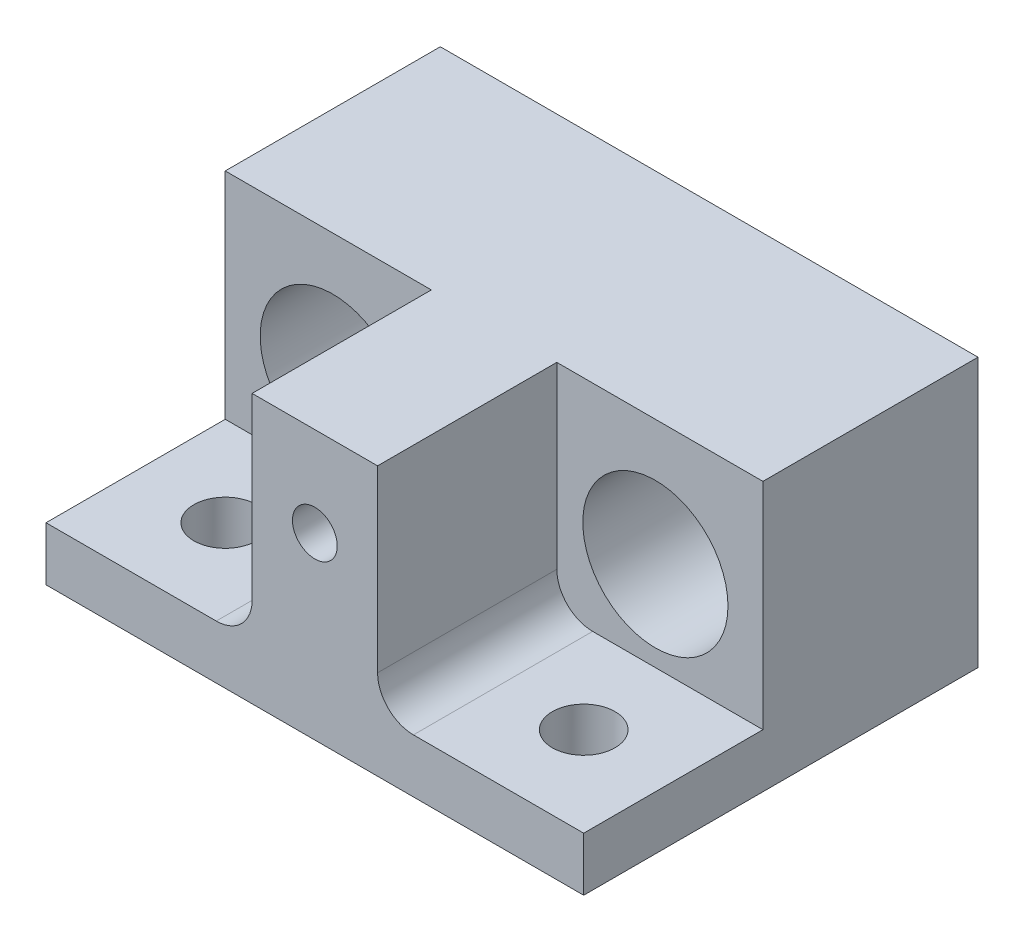
ISO-10303-21;
HEADER;
FILE_DESCRIPTION(('STEP AP214'),'2;1');
FILE_NAME('part.step','',(''),(''),'','','');
FILE_SCHEMA(('AUTOMOTIVE_DESIGN { 1 0 10303 214 1 1 1 1 }'));
ENDSEC;
DATA;
#1=APPLICATION_CONTEXT('core data for automotive mechanical design processes');
#2=APPLICATION_PROTOCOL_DEFINITION('international standard','automotive_design',2000,#1);
#3=PRODUCT_CONTEXT('',#1,'mechanical');
#4=PRODUCT('Part','Part','',(#3));
#5=PRODUCT_RELATED_PRODUCT_CATEGORY('part','',(#4));
#6=PRODUCT_DEFINITION_FORMATION('','',#4);
#7=PRODUCT_DEFINITION_CONTEXT('part definition',#1,'design');
#8=PRODUCT_DEFINITION('design','',#6,#7);
#9=PRODUCT_DEFINITION_SHAPE('','',#8);
#10=(LENGTH_UNIT() NAMED_UNIT(*) SI_UNIT(.MILLI.,.METRE.));
#11=(NAMED_UNIT(*) PLANE_ANGLE_UNIT() SI_UNIT($,.RADIAN.));
#12=(NAMED_UNIT(*) SI_UNIT($,.STERADIAN.) SOLID_ANGLE_UNIT());
#13=UNCERTAINTY_MEASURE_WITH_UNIT(LENGTH_MEASURE(1.E-05),#10,'distance_accuracy_value','');
#14=(GEOMETRIC_REPRESENTATION_CONTEXT(3) GLOBAL_UNCERTAINTY_ASSIGNED_CONTEXT((#13)) GLOBAL_UNIT_ASSIGNED_CONTEXT((#10,
#11,#12)) REPRESENTATION_CONTEXT('',''));
#15=CARTESIAN_POINT('',(0.,0.,0.));
#16=DIRECTION('',(0.,0.,1.));
#17=DIRECTION('',(1.,0.,0.));
#18=AXIS2_PLACEMENT_3D('',#15,#16,#17);
#19=CARTESIAN_POINT('',(15.,15.,11.));
#20=DIRECTION('',(-1.,0.,0.));
#21=DIRECTION('',(0.,0.,1.));
#22=AXIS2_PLACEMENT_3D('',#19,#20,#21);
#23=PLANE('',#22);
#24=DIRECTION('',(0.,0.,-1.));
#25=VECTOR('',#24,1.);
#26=CARTESIAN_POINT('',(15.,15.,11.));
#27=LINE('',#26,#25);
#28=CARTESIAN_POINT('',(15.,15.,0.999999999999999));
#29=VERTEX_POINT('',#28);
#30=CARTESIAN_POINT('',(15.,15.,-11.));
#31=VERTEX_POINT('',#30);
#32=EDGE_CURVE('E215',#29,#31,#27,.T.);
#33=ORIENTED_EDGE('',*,*,#32,.F.);
#34=DIRECTION('',(0.,1.,0.));
#35=VECTOR('',#34,1.);
#36=CARTESIAN_POINT('',(15.,3.,0.999999999999999));
#37=LINE('',#36,#35);
#38=CARTESIAN_POINT('',(15.,3.,0.999999999999999));
#39=VERTEX_POINT('',#38);
#40=EDGE_CURVE('E193',#39,#29,#37,.T.);
#41=ORIENTED_EDGE('',*,*,#40,.F.);
#42=DIRECTION('',(0.,0.,-1.));
#43=VECTOR('',#42,1.);
#44=CARTESIAN_POINT('',(15.,3.,11.));
#45=LINE('',#44,#43);
#46=CARTESIAN_POINT('',(15.,3.,11.));
#47=VERTEX_POINT('',#46);
#48=EDGE_CURVE('E179',#47,#39,#45,.T.);
#49=ORIENTED_EDGE('',*,*,#48,.F.);
#50=DIRECTION('',(0.,-1.,0.));
#51=VECTOR('',#50,1.);
#52=CARTESIAN_POINT('',(15.,15.,11.));
#53=LINE('',#52,#51);
#54=CARTESIAN_POINT('',(15.,0.,11.));
#55=VERTEX_POINT('',#54);
#56=EDGE_CURVE('E226',#47,#55,#53,.T.);
#57=ORIENTED_EDGE('',*,*,#56,.T.);
#58=DIRECTION('',(0.,0.,-1.));
#59=VECTOR('',#58,1.);
#60=CARTESIAN_POINT('',(15.,0.,11.));
#61=LINE('',#60,#59);
#62=CARTESIAN_POINT('',(15.,0.,-11.));
#63=VERTEX_POINT('',#62);
#64=EDGE_CURVE('E211',#55,#63,#61,.T.);
#65=ORIENTED_EDGE('',*,*,#64,.T.);
#66=DIRECTION('',(0.,-1.,0.));
#67=VECTOR('',#66,1.);
#68=CARTESIAN_POINT('',(15.,15.,-11.));
#69=LINE('',#68,#67);
#70=EDGE_CURVE('E242',#31,#63,#69,.T.);
#71=ORIENTED_EDGE('',*,*,#70,.F.);
#72=EDGE_LOOP('',(#33,#41,#49,#57,#65,#71));
#73=FACE_BOUND('',#72,.T.);
#74=ADVANCED_FACE('F48',(#73),#23,.F.);
#75=CARTESIAN_POINT('',(-15.,15.,-11.));
#76=DIRECTION('',(0.,0.,1.));
#77=DIRECTION('',(1.,0.,0.));
#78=AXIS2_PLACEMENT_3D('',#75,#76,#77);
#79=PLANE('',#78);
#80=CARTESIAN_POINT('',(9.,8.,-11.));
#81=DIRECTION('',(0.,0.,1.));
#82=DIRECTION('',(1.,0.,0.));
#83=AXIS2_PLACEMENT_3D('',#80,#81,#82);
#84=CIRCLE('',#83,4.05);
#85=CARTESIAN_POINT('',(13.05,8.,-11.));
#86=VERTEX_POINT('',#85);
#87=EDGE_CURVE('E165',#86,#86,#84,.T.);
#88=ORIENTED_EDGE('',*,*,#87,.T.);
#89=EDGE_LOOP('',(#88));
#90=FACE_BOUND('',#89,.T.);
#91=CARTESIAN_POINT('',(-9.,8.,-11.));
#92=DIRECTION('',(0.,0.,1.));
#93=DIRECTION('',(1.,0.,0.));
#94=AXIS2_PLACEMENT_3D('',#91,#92,#93);
#95=CIRCLE('',#94,4.05);
#96=CARTESIAN_POINT('',(-4.95,8.,-11.));
#97=VERTEX_POINT('',#96);
#98=EDGE_CURVE('E171',#97,#97,#95,.T.);
#99=ORIENTED_EDGE('',*,*,#98,.T.);
#100=EDGE_LOOP('',(#99));
#101=FACE_BOUND('',#100,.T.);
#102=DIRECTION('',(-1.,0.,0.));
#103=VECTOR('',#102,1.);
#104=CARTESIAN_POINT('',(-15.,0.,-11.));
#105=LINE('',#104,#103);
#106=CARTESIAN_POINT('',(-15.,0.,-11.));
#107=VERTEX_POINT('',#106);
#108=EDGE_CURVE('E229',#63,#107,#105,.T.);
#109=ORIENTED_EDGE('',*,*,#108,.T.);
#110=DIRECTION('',(0.,-1.,0.));
#111=VECTOR('',#110,1.);
#112=CARTESIAN_POINT('',(-15.,15.,-11.));
#113=LINE('',#112,#111);
#114=CARTESIAN_POINT('',(-15.,15.,-11.));
#115=VERTEX_POINT('',#114);
#116=EDGE_CURVE('E239',#115,#107,#113,.T.);
#117=ORIENTED_EDGE('',*,*,#116,.F.);
#118=DIRECTION('',(-1.,0.,0.));
#119=VECTOR('',#118,1.);
#120=CARTESIAN_POINT('',(-15.,15.,-11.));
#121=LINE('',#120,#119);
#122=EDGE_CURVE('E217',#31,#115,#121,.T.);
#123=ORIENTED_EDGE('',*,*,#122,.F.);
#124=ORIENTED_EDGE('',*,*,#70,.T.);
#125=EDGE_LOOP('',(#109,#117,#123,#124));
#126=FACE_BOUND('',#125,.T.);
#127=ADVANCED_FACE('F290',(#90,#101,#126),#79,.F.);
#128=CARTESIAN_POINT('',(-15.,15.,11.));
#129=DIRECTION('',(1.,0.,0.));
#130=DIRECTION('',(0.,0.,-1.));
#131=AXIS2_PLACEMENT_3D('',#128,#129,#130);
#132=PLANE('',#131);
#133=DIRECTION('',(0.,0.,1.));
#134=VECTOR('',#133,1.);
#135=CARTESIAN_POINT('',(-15.,3.,11.));
#136=LINE('',#135,#134);
#137=CARTESIAN_POINT('',(-15.,3.,0.999999999999997));
#138=VERTEX_POINT('',#137);
#139=CARTESIAN_POINT('',(-15.,3.,11.));
#140=VERTEX_POINT('',#139);
#141=EDGE_CURVE('E196',#138,#140,#136,.T.);
#142=ORIENTED_EDGE('',*,*,#141,.F.);
#143=DIRECTION('',(0.,1.,0.));
#144=VECTOR('',#143,1.);
#145=CARTESIAN_POINT('',(-15.,3.,0.999999999999997));
#146=LINE('',#145,#144);
#147=CARTESIAN_POINT('',(-15.,15.,0.999999999999997));
#148=VERTEX_POINT('',#147);
#149=EDGE_CURVE('E208',#138,#148,#146,.T.);
#150=ORIENTED_EDGE('',*,*,#149,.T.);
#151=DIRECTION('',(0.,0.,1.));
#152=VECTOR('',#151,1.);
#153=CARTESIAN_POINT('',(-15.,15.,11.));
#154=LINE('',#153,#152);
#155=EDGE_CURVE('E220',#115,#148,#154,.T.);
#156=ORIENTED_EDGE('',*,*,#155,.F.);
#157=ORIENTED_EDGE('',*,*,#116,.T.);
#158=DIRECTION('',(0.,0.,1.));
#159=VECTOR('',#158,1.);
#160=CARTESIAN_POINT('',(-15.,0.,11.));
#161=LINE('',#160,#159);
#162=CARTESIAN_POINT('',(-15.,0.,11.));
#163=VERTEX_POINT('',#162);
#164=EDGE_CURVE('E231',#107,#163,#161,.T.);
#165=ORIENTED_EDGE('',*,*,#164,.T.);
#166=DIRECTION('',(0.,-1.,0.));
#167=VECTOR('',#166,1.);
#168=CARTESIAN_POINT('',(-15.,15.,11.));
#169=LINE('',#168,#167);
#170=EDGE_CURVE('E237',#140,#163,#169,.T.);
#171=ORIENTED_EDGE('',*,*,#170,.F.);
#172=EDGE_LOOP('',(#142,#150,#156,#157,#165,#171));
#173=FACE_BOUND('',#172,.T.);
#174=ADVANCED_FACE('F307',(#173),#132,.F.);
#175=CARTESIAN_POINT('',(-15.,15.,11.));
#176=DIRECTION('',(0.,0.,-1.));
#177=DIRECTION('',(-1.,0.,0.));
#178=AXIS2_PLACEMENT_3D('',#175,#176,#177);
#179=PLANE('',#178);
#180=CARTESIAN_POINT('',(1.67961437001518E-13,10.0000000000001,11.));
#181=DIRECTION('',(0.,0.,1.));
#182=DIRECTION('',(1.,0.,0.));
#183=AXIS2_PLACEMENT_3D('',#180,#181,#182);
#184=CIRCLE('',#183,1.24999999999999);
#185=CARTESIAN_POINT('',(1.25000000000016,10.0000000000001,11.));
#186=VERTEX_POINT('',#185);
#187=EDGE_CURVE('E148',#186,#186,#184,.T.);
#188=ORIENTED_EDGE('',*,*,#187,.F.);
#189=EDGE_LOOP('',(#188));
#190=FACE_BOUND('',#189,.T.);
#191=DIRECTION('',(1.,0.,0.));
#192=VECTOR('',#191,1.);
#193=CARTESIAN_POINT('',(3.5,3.,11.));
#194=LINE('',#193,#192);
#195=CARTESIAN_POINT('',(5.5,3.,11.));
#196=VERTEX_POINT('',#195);
#197=EDGE_CURVE('E177',#196,#47,#194,.T.);
#198=ORIENTED_EDGE('',*,*,#197,.F.);
#199=CARTESIAN_POINT('',(5.5,5.,11.));
#200=DIRECTION('',(0.,0.,-1.));
#201=DIRECTION('',(-1.,0.,0.));
#202=AXIS2_PLACEMENT_3D('',#199,#200,#201);
#203=CIRCLE('',#202,2.);
#204=CARTESIAN_POINT('',(3.5,5.,11.));
#205=VERTEX_POINT('',#204);
#206=EDGE_CURVE('E56',#196,#205,#203,.T.);
#207=ORIENTED_EDGE('',*,*,#206,.T.);
#208=DIRECTION('',(0.,1.,0.));
#209=VECTOR('',#208,1.);
#210=CARTESIAN_POINT('',(3.5,3.,11.));
#211=LINE('',#210,#209);
#212=CARTESIAN_POINT('',(3.5,15.,11.));
#213=VERTEX_POINT('',#212);
#214=EDGE_CURVE('E185',#205,#213,#211,.T.);
#215=ORIENTED_EDGE('',*,*,#214,.T.);
#216=DIRECTION('',(1.,0.,0.));
#217=VECTOR('',#216,1.);
#218=CARTESIAN_POINT('',(-15.,15.,11.));
#219=LINE('',#218,#217);
#220=CARTESIAN_POINT('',(-3.5,15.,11.));
#221=VERTEX_POINT('',#220);
#222=EDGE_CURVE('E223',#221,#213,#219,.T.);
#223=ORIENTED_EDGE('',*,*,#222,.F.);
#224=DIRECTION('',(0.,1.,0.));
#225=VECTOR('',#224,1.);
#226=CARTESIAN_POINT('',(-3.5,3.,11.));
#227=LINE('',#226,#225);
#228=CARTESIAN_POINT('',(-3.5,5.,11.));
#229=VERTEX_POINT('',#228);
#230=EDGE_CURVE('E204',#229,#221,#227,.T.);
#231=ORIENTED_EDGE('',*,*,#230,.F.);
#232=CARTESIAN_POINT('',(-5.5,5.,11.));
#233=DIRECTION('',(0.,0.,-1.));
#234=DIRECTION('',(-1.,0.,0.));
#235=AXIS2_PLACEMENT_3D('',#232,#233,#234);
#236=CIRCLE('',#235,2.);
#237=CARTESIAN_POINT('',(-5.5,3.,11.));
#238=VERTEX_POINT('',#237);
#239=EDGE_CURVE('E13',#229,#238,#236,.T.);
#240=ORIENTED_EDGE('',*,*,#239,.T.);
#241=DIRECTION('',(1.,0.,0.));
#242=VECTOR('',#241,1.);
#243=CARTESIAN_POINT('',(-15.,3.,11.));
#244=LINE('',#243,#242);
#245=EDGE_CURVE('E198',#140,#238,#244,.T.);
#246=ORIENTED_EDGE('',*,*,#245,.F.);
#247=ORIENTED_EDGE('',*,*,#170,.T.);
#248=DIRECTION('',(1.,0.,0.));
#249=VECTOR('',#248,1.);
#250=CARTESIAN_POINT('',(-15.,0.,11.));
#251=LINE('',#250,#249);
#252=EDGE_CURVE('E218',#163,#55,#251,.T.);
#253=ORIENTED_EDGE('',*,*,#252,.T.);
#254=ORIENTED_EDGE('',*,*,#56,.F.);
#255=EDGE_LOOP('',(#198,#207,#215,#223,#231,#240,#246,#247,#253,#254));
#256=FACE_BOUND('',#255,.T.);
#257=ADVANCED_FACE('F259',(#190,#256),#179,.F.);
#258=CARTESIAN_POINT('',(0.,15.,0.));
#259=DIRECTION('',(0.,-1.,0.));
#260=DIRECTION('',(0.,0.,-1.));
#261=AXIS2_PLACEMENT_3D('',#258,#259,#260);
#262=PLANE('',#261);
#263=ORIENTED_EDGE('',*,*,#222,.T.);
#264=DIRECTION('',(0.,0.,1.));
#265=VECTOR('',#264,1.);
#266=CARTESIAN_POINT('',(3.5,15.,11.));
#267=LINE('',#266,#265);
#268=CARTESIAN_POINT('',(3.5,15.,0.999999999999999));
#269=VERTEX_POINT('',#268);
#270=EDGE_CURVE('E174',#269,#213,#267,.T.);
#271=ORIENTED_EDGE('',*,*,#270,.F.);
#272=DIRECTION('',(-1.,0.,0.));
#273=VECTOR('',#272,1.);
#274=CARTESIAN_POINT('',(3.5,15.,0.999999999999999));
#275=LINE('',#274,#273);
#276=EDGE_CURVE('E180',#29,#269,#275,.T.);
#277=ORIENTED_EDGE('',*,*,#276,.F.);
#278=ORIENTED_EDGE('',*,*,#32,.T.);
#279=ORIENTED_EDGE('',*,*,#122,.T.);
#280=ORIENTED_EDGE('',*,*,#155,.T.);
#281=DIRECTION('',(-1.,0.,0.));
#282=VECTOR('',#281,1.);
#283=CARTESIAN_POINT('',(-15.,15.,0.999999999999997));
#284=LINE('',#283,#282);
#285=CARTESIAN_POINT('',(-3.5,15.,0.999999999999998));
#286=VERTEX_POINT('',#285);
#287=EDGE_CURVE('E199',#286,#148,#284,.T.);
#288=ORIENTED_EDGE('',*,*,#287,.F.);
#289=DIRECTION('',(0.,0.,-1.));
#290=VECTOR('',#289,1.);
#291=CARTESIAN_POINT('',(-3.5,15.,11.));
#292=LINE('',#291,#290);
#293=EDGE_CURVE('E192',#221,#286,#292,.T.);
#294=ORIENTED_EDGE('',*,*,#293,.F.);
#295=EDGE_LOOP('',(#263,#271,#277,#278,#279,#280,#288,#294));
#296=FACE_BOUND('',#295,.T.);
#297=ADVANCED_FACE('F294',(#296),#262,.F.);
#298=CARTESIAN_POINT('',(0.,0.,0.));
#299=DIRECTION('',(0.,-1.,0.));
#300=DIRECTION('',(0.,0.,-1.));
#301=AXIS2_PLACEMENT_3D('',#298,#299,#300);
#302=PLANE('',#301);
#303=CARTESIAN_POINT('',(10.,0.,6.));
#304=DIRECTION('',(0.,-1.,0.));
#305=DIRECTION('',(0.,0.,-1.));
#306=AXIS2_PLACEMENT_3D('',#303,#304,#305);
#307=CIRCLE('',#306,1.75);
#308=CARTESIAN_POINT('',(10.,0.,4.25));
#309=VERTEX_POINT('',#308);
#310=EDGE_CURVE('E147',#309,#309,#307,.F.);
#311=ORIENTED_EDGE('',*,*,#310,.T.);
#312=EDGE_LOOP('',(#311));
#313=FACE_BOUND('',#312,.T.);
#314=CARTESIAN_POINT('',(-10.,0.,6.));
#315=DIRECTION('',(0.,-1.,0.));
#316=DIRECTION('',(0.,0.,-1.));
#317=AXIS2_PLACEMENT_3D('',#314,#315,#316);
#318=CIRCLE('',#317,1.75);
#319=CARTESIAN_POINT('',(-10.,0.,4.25));
#320=VERTEX_POINT('',#319);
#321=EDGE_CURVE('E157',#320,#320,#318,.F.);
#322=ORIENTED_EDGE('',*,*,#321,.T.);
#323=EDGE_LOOP('',(#322));
#324=FACE_BOUND('',#323,.T.);
#325=ORIENTED_EDGE('',*,*,#64,.F.);
#326=ORIENTED_EDGE('',*,*,#252,.F.);
#327=ORIENTED_EDGE('',*,*,#164,.F.);
#328=ORIENTED_EDGE('',*,*,#108,.F.);
#329=EDGE_LOOP('',(#325,#326,#327,#328));
#330=FACE_BOUND('',#329,.T.);
#331=ADVANCED_FACE('F286',(#313,#324,#330),#302,.T.);
#332=CARTESIAN_POINT('',(-15.,3.,0.999999999999997));
#333=DIRECTION('',(0.,0.,-1.));
#334=DIRECTION('',(-1.,0.,0.));
#335=AXIS2_PLACEMENT_3D('',#332,#333,#334);
#336=PLANE('',#335);
#337=CARTESIAN_POINT('',(-9.,8.,0.999999999999999));
#338=DIRECTION('',(0.,0.,1.));
#339=DIRECTION('',(1.,0.,0.));
#340=AXIS2_PLACEMENT_3D('',#337,#338,#339);
#341=CIRCLE('',#340,4.05);
#342=CARTESIAN_POINT('',(-4.95,8.,0.999999999999999));
#343=VERTEX_POINT('',#342);
#344=EDGE_CURVE('E168',#343,#343,#341,.T.);
#345=ORIENTED_EDGE('',*,*,#344,.F.);
#346=EDGE_LOOP('',(#345));
#347=FACE_BOUND('',#346,.T.);
#348=DIRECTION('',(-1.,0.,0.));
#349=VECTOR('',#348,1.);
#350=CARTESIAN_POINT('',(-15.,3.,0.999999999999997));
#351=LINE('',#350,#349);
#352=CARTESIAN_POINT('',(-5.5,3.,0.999999999999998));
#353=VERTEX_POINT('',#352);
#354=EDGE_CURVE('E202',#353,#138,#351,.T.);
#355=ORIENTED_EDGE('',*,*,#354,.F.);
#356=CARTESIAN_POINT('',(-5.5,5.,0.999999999999998));
#357=DIRECTION('',(0.,0.,-1.));
#358=DIRECTION('',(-1.,0.,0.));
#359=AXIS2_PLACEMENT_3D('',#356,#357,#358);
#360=CIRCLE('',#359,2.);
#361=CARTESIAN_POINT('',(-3.5,5.,0.999999999999998));
#362=VERTEX_POINT('',#361);
#363=EDGE_CURVE('E71',#353,#362,#360,.F.);
#364=ORIENTED_EDGE('',*,*,#363,.T.);
#365=DIRECTION('',(0.,1.,0.));
#366=VECTOR('',#365,1.);
#367=CARTESIAN_POINT('',(-3.5,3.,0.999999999999998));
#368=LINE('',#367,#366);
#369=EDGE_CURVE('E212',#362,#286,#368,.T.);
#370=ORIENTED_EDGE('',*,*,#369,.T.);
#371=ORIENTED_EDGE('',*,*,#287,.T.);
#372=ORIENTED_EDGE('',*,*,#149,.F.);
#373=EDGE_LOOP('',(#355,#364,#370,#371,#372));
#374=FACE_BOUND('',#373,.T.);
#375=ADVANCED_FACE('F304',(#347,#374),#336,.F.);
#376=CARTESIAN_POINT('',(-3.5,3.,11.));
#377=DIRECTION('',(1.,0.,0.));
#378=DIRECTION('',(0.,0.,-1.));
#379=AXIS2_PLACEMENT_3D('',#376,#377,#378);
#380=PLANE('',#379);
#381=ORIENTED_EDGE('',*,*,#369,.F.);
#382=DIRECTION('',(0.,0.,-1.));
#383=VECTOR('',#382,1.);
#384=CARTESIAN_POINT('',(-3.5,5.,11.));
#385=LINE('',#384,#383);
#386=EDGE_CURVE('E63',#362,#229,#385,.F.);
#387=ORIENTED_EDGE('',*,*,#386,.T.);
#388=ORIENTED_EDGE('',*,*,#230,.T.);
#389=ORIENTED_EDGE('',*,*,#293,.T.);
#390=EDGE_LOOP('',(#381,#387,#388,#389));
#391=FACE_BOUND('',#390,.T.);
#392=ADVANCED_FACE('F344',(#391),#380,.F.);
#393=CARTESIAN_POINT('',(0.,3.,0.));
#394=DIRECTION('',(0.,-1.,0.));
#395=DIRECTION('',(0.,0.,-1.));
#396=AXIS2_PLACEMENT_3D('',#393,#394,#395);
#397=PLANE('',#396);
#398=CARTESIAN_POINT('',(-10.,3.,6.));
#399=DIRECTION('',(0.,1.,0.));
#400=DIRECTION('',(0.,0.,1.));
#401=AXIS2_PLACEMENT_3D('',#398,#399,#400);
#402=CIRCLE('',#401,1.75);
#403=CARTESIAN_POINT('',(-10.,3.,7.75));
#404=VERTEX_POINT('',#403);
#405=EDGE_CURVE('E159',#404,#404,#402,.T.);
#406=ORIENTED_EDGE('',*,*,#405,.F.);
#407=EDGE_LOOP('',(#406));
#408=FACE_BOUND('',#407,.T.);
#409=ORIENTED_EDGE('',*,*,#245,.T.);
#410=DIRECTION('',(0.,0.,-1.));
#411=VECTOR('',#410,1.);
#412=CARTESIAN_POINT('',(-5.5,3.,0.999999999999998));
#413=LINE('',#412,#411);
#414=EDGE_CURVE('E252',#238,#353,#413,.T.);
#415=ORIENTED_EDGE('',*,*,#414,.T.);
#416=ORIENTED_EDGE('',*,*,#354,.T.);
#417=ORIENTED_EDGE('',*,*,#141,.T.);
#418=EDGE_LOOP('',(#409,#415,#416,#417));
#419=FACE_BOUND('',#418,.T.);
#420=ADVANCED_FACE('F302',(#408,#419),#397,.F.);
#421=CARTESIAN_POINT('',(3.5,3.,11.));
#422=DIRECTION('',(-1.,0.,0.));
#423=DIRECTION('',(0.,0.,1.));
#424=AXIS2_PLACEMENT_3D('',#421,#422,#423);
#425=PLANE('',#424);
#426=ORIENTED_EDGE('',*,*,#214,.F.);
#427=DIRECTION('',(0.,0.,1.));
#428=VECTOR('',#427,1.);
#429=CARTESIAN_POINT('',(3.5,5.,0.999999999999999));
#430=LINE('',#429,#428);
#431=CARTESIAN_POINT('',(3.5,5.,0.999999999999999));
#432=VERTEX_POINT('',#431);
#433=EDGE_CURVE('E248',#205,#432,#430,.F.);
#434=ORIENTED_EDGE('',*,*,#433,.T.);
#435=DIRECTION('',(0.,1.,0.));
#436=VECTOR('',#435,1.);
#437=CARTESIAN_POINT('',(3.5,3.,0.999999999999999));
#438=LINE('',#437,#436);
#439=EDGE_CURVE('E190',#432,#269,#438,.T.);
#440=ORIENTED_EDGE('',*,*,#439,.T.);
#441=ORIENTED_EDGE('',*,*,#270,.T.);
#442=EDGE_LOOP('',(#426,#434,#440,#441));
#443=FACE_BOUND('',#442,.T.);
#444=ADVANCED_FACE('F266',(#443),#425,.F.);
#445=CARTESIAN_POINT('',(3.5,3.,0.999999999999999));
#446=DIRECTION('',(0.,0.,-1.));
#447=DIRECTION('',(-1.,0.,0.));
#448=AXIS2_PLACEMENT_3D('',#445,#446,#447);
#449=PLANE('',#448);
#450=CARTESIAN_POINT('',(9.,8.,0.999999999999999));
#451=DIRECTION('',(0.,0.,1.));
#452=DIRECTION('',(1.,0.,0.));
#453=AXIS2_PLACEMENT_3D('',#450,#451,#452);
#454=CIRCLE('',#453,4.05);
#455=CARTESIAN_POINT('',(13.05,8.,0.999999999999999));
#456=VERTEX_POINT('',#455);
#457=EDGE_CURVE('E162',#456,#456,#454,.T.);
#458=ORIENTED_EDGE('',*,*,#457,.F.);
#459=EDGE_LOOP('',(#458));
#460=FACE_BOUND('',#459,.T.);
#461=ORIENTED_EDGE('',*,*,#439,.F.);
#462=CARTESIAN_POINT('',(5.5,5.,0.999999999999999));
#463=DIRECTION('',(0.,0.,-1.));
#464=DIRECTION('',(-1.,0.,0.));
#465=AXIS2_PLACEMENT_3D('',#462,#463,#464);
#466=CIRCLE('',#465,2.);
#467=CARTESIAN_POINT('',(5.5,3.,0.999999999999999));
#468=VERTEX_POINT('',#467);
#469=EDGE_CURVE('E250',#432,#468,#466,.F.);
#470=ORIENTED_EDGE('',*,*,#469,.T.);
#471=DIRECTION('',(-1.,0.,0.));
#472=VECTOR('',#471,1.);
#473=CARTESIAN_POINT('',(3.5,3.,0.999999999999999));
#474=LINE('',#473,#472);
#475=EDGE_CURVE('E182',#39,#468,#474,.T.);
#476=ORIENTED_EDGE('',*,*,#475,.F.);
#477=ORIENTED_EDGE('',*,*,#40,.T.);
#478=ORIENTED_EDGE('',*,*,#276,.T.);
#479=EDGE_LOOP('',(#461,#470,#476,#477,#478));
#480=FACE_BOUND('',#479,.T.);
#481=ADVANCED_FACE('F273',(#460,#480),#449,.F.);
#482=CARTESIAN_POINT('',(0.,3.,0.));
#483=DIRECTION('',(0.,-1.,0.));
#484=DIRECTION('',(0.,0.,-1.));
#485=AXIS2_PLACEMENT_3D('',#482,#483,#484);
#486=PLANE('',#485);
#487=CARTESIAN_POINT('',(10.,3.,6.));
#488=DIRECTION('',(0.,1.,0.));
#489=DIRECTION('',(0.,0.,1.));
#490=AXIS2_PLACEMENT_3D('',#487,#488,#489);
#491=CIRCLE('',#490,1.75);
#492=CARTESIAN_POINT('',(10.,3.,7.75));
#493=VERTEX_POINT('',#492);
#494=EDGE_CURVE('E151',#493,#493,#491,.T.);
#495=ORIENTED_EDGE('',*,*,#494,.F.);
#496=EDGE_LOOP('',(#495));
#497=FACE_BOUND('',#496,.T.);
#498=ORIENTED_EDGE('',*,*,#475,.T.);
#499=DIRECTION('',(0.,0.,1.));
#500=VECTOR('',#499,1.);
#501=CARTESIAN_POINT('',(5.5,3.,11.));
#502=LINE('',#501,#500);
#503=EDGE_CURVE('E245',#468,#196,#502,.T.);
#504=ORIENTED_EDGE('',*,*,#503,.T.);
#505=ORIENTED_EDGE('',*,*,#197,.T.);
#506=ORIENTED_EDGE('',*,*,#48,.T.);
#507=EDGE_LOOP('',(#498,#504,#505,#506));
#508=FACE_BOUND('',#507,.T.);
#509=ADVANCED_FACE('F276',(#497,#508),#486,.F.);
#510=CARTESIAN_POINT('',(5.5,5.,0.));
#511=DIRECTION('',(0.,0.,-1.));
#512=DIRECTION('',(-1.,0.,0.));
#513=AXIS2_PLACEMENT_3D('',#510,#511,#512);
#514=CYLINDRICAL_SURFACE('',#513,2.);
#515=ORIENTED_EDGE('',*,*,#469,.F.);
#516=ORIENTED_EDGE('',*,*,#433,.F.);
#517=ORIENTED_EDGE('',*,*,#206,.F.);
#518=ORIENTED_EDGE('',*,*,#503,.F.);
#519=EDGE_LOOP('',(#515,#516,#517,#518));
#520=FACE_BOUND('',#519,.T.);
#521=ADVANCED_FACE('F270',(#520),#514,.F.);
#522=CARTESIAN_POINT('',(-5.5,5.,0.));
#523=DIRECTION('',(0.,0.,1.));
#524=DIRECTION('',(1.,0.,0.));
#525=AXIS2_PLACEMENT_3D('',#522,#523,#524);
#526=CYLINDRICAL_SURFACE('',#525,2.);
#527=ORIENTED_EDGE('',*,*,#239,.F.);
#528=ORIENTED_EDGE('',*,*,#386,.F.);
#529=ORIENTED_EDGE('',*,*,#363,.F.);
#530=ORIENTED_EDGE('',*,*,#414,.F.);
#531=EDGE_LOOP('',(#527,#528,#529,#530));
#532=FACE_BOUND('',#531,.T.);
#533=ADVANCED_FACE('F50',(#532),#526,.F.);
#534=CARTESIAN_POINT('',(-9.,8.,-11.));
#535=DIRECTION('',(0.,0.,1.));
#536=DIRECTION('',(1.,0.,0.));
#537=AXIS2_PLACEMENT_3D('',#534,#535,#536);
#538=CYLINDRICAL_SURFACE('',#537,4.05);
#539=ORIENTED_EDGE('',*,*,#98,.F.);
#540=EDGE_LOOP('',(#539));
#541=FACE_BOUND('',#540,.T.);
#542=ORIENTED_EDGE('',*,*,#344,.T.);
#543=EDGE_LOOP('',(#542));
#544=FACE_BOUND('',#543,.T.);
#545=ADVANCED_FACE('F328',(#541,#544),#538,.F.);
#546=CARTESIAN_POINT('',(9.,8.,-11.));
#547=DIRECTION('',(0.,0.,1.));
#548=DIRECTION('',(1.,0.,0.));
#549=AXIS2_PLACEMENT_3D('',#546,#547,#548);
#550=CYLINDRICAL_SURFACE('',#549,4.05);
#551=ORIENTED_EDGE('',*,*,#87,.F.);
#552=EDGE_LOOP('',(#551));
#553=FACE_BOUND('',#552,.T.);
#554=ORIENTED_EDGE('',*,*,#457,.T.);
#555=EDGE_LOOP('',(#554));
#556=FACE_BOUND('',#555,.T.);
#557=ADVANCED_FACE('F364',(#553,#556),#550,.F.);
#558=CARTESIAN_POINT('',(-10.,-0.00100000000000013,6.));
#559=DIRECTION('',(0.,1.,0.));
#560=DIRECTION('',(0.,0.,1.));
#561=AXIS2_PLACEMENT_3D('',#558,#559,#560);
#562=CYLINDRICAL_SURFACE('',#561,1.75);
#563=ORIENTED_EDGE('',*,*,#321,.F.);
#564=EDGE_LOOP('',(#563));
#565=FACE_BOUND('',#564,.T.);
#566=ORIENTED_EDGE('',*,*,#405,.T.);
#567=EDGE_LOOP('',(#566));
#568=FACE_BOUND('',#567,.T.);
#569=ADVANCED_FACE('F361',(#565,#568),#562,.F.);
#570=CARTESIAN_POINT('',(10.,-0.00100000000000013,6.));
#571=DIRECTION('',(0.,1.,0.));
#572=DIRECTION('',(0.,0.,1.));
#573=AXIS2_PLACEMENT_3D('',#570,#571,#572);
#574=CYLINDRICAL_SURFACE('',#573,1.75);
#575=ORIENTED_EDGE('',*,*,#310,.F.);
#576=EDGE_LOOP('',(#575));
#577=FACE_BOUND('',#576,.T.);
#578=ORIENTED_EDGE('',*,*,#494,.T.);
#579=EDGE_LOOP('',(#578));
#580=FACE_BOUND('',#579,.T.);
#581=ADVANCED_FACE('F141',(#577,#580),#574,.F.);
#582=CARTESIAN_POINT('',(1.67961437001518E-13,10.0000000000001,0.999999999999999));
#583=DIRECTION('',(0.,0.,1.));
#584=DIRECTION('',(1.,0.,0.));
#585=AXIS2_PLACEMENT_3D('',#582,#583,#584);
#586=CONICAL_SURFACE('',#585,1.25,1.02974425867665);
#587=CARTESIAN_POINT('',(1.65328182894766E-13,10.0000000000001,0.248924226215547));
#588=VERTEX_POINT('',#587);
#589=VERTEX_LOOP('',#588);
#590=FACE_BOUND('',#589,.T.);
#591=CARTESIAN_POINT('',(1.67961437001518E-13,10.0000000000001,0.999999999999999));
#592=DIRECTION('',(0.,0.,1.));
#593=DIRECTION('',(1.,0.,0.));
#594=AXIS2_PLACEMENT_3D('',#591,#592,#593);
#595=CIRCLE('',#594,1.25);
#596=CARTESIAN_POINT('',(1.25000000000017,10.0000000000001,0.999999999999999));
#597=VERTEX_POINT('',#596);
#598=EDGE_CURVE('E145',#597,#597,#595,.T.);
#599=ORIENTED_EDGE('',*,*,#598,.T.);
#600=EDGE_LOOP('',(#599));
#601=FACE_BOUND('',#600,.T.);
#602=ADVANCED_FACE('F137',(#590,#601),#586,.F.);
#603=CARTESIAN_POINT('',(1.67961437001518E-13,10.0000000000001,11.));
#604=DIRECTION('',(0.,0.,1.));
#605=DIRECTION('',(1.,0.,0.));
#606=AXIS2_PLACEMENT_3D('',#603,#604,#605);
#607=CYLINDRICAL_SURFACE('',#606,1.24999999999999);
#608=ORIENTED_EDGE('',*,*,#598,.F.);
#609=EDGE_LOOP('',(#608));
#610=FACE_BOUND('',#609,.T.);
#611=ORIENTED_EDGE('',*,*,#187,.T.);
#612=EDGE_LOOP('',(#611));
#613=FACE_BOUND('',#612,.T.);
#614=ADVANCED_FACE('F140',(#610,#613),#607,.F.);
#615=CLOSED_SHELL('',(#74,#127,#174,#257,#297,#331,#375,#392,#420,#444,#481,#509,#521,#533,#545,
#557,#569,#581,#602,#614));
#616=MANIFOLD_SOLID_BREP('B2',#615);
#617=ADVANCED_BREP_SHAPE_REPRESENTATION('',(#18,#616),#14);
#618=SHAPE_DEFINITION_REPRESENTATION(#9,#617);
ENDSEC;
END-ISO-10303-21;
